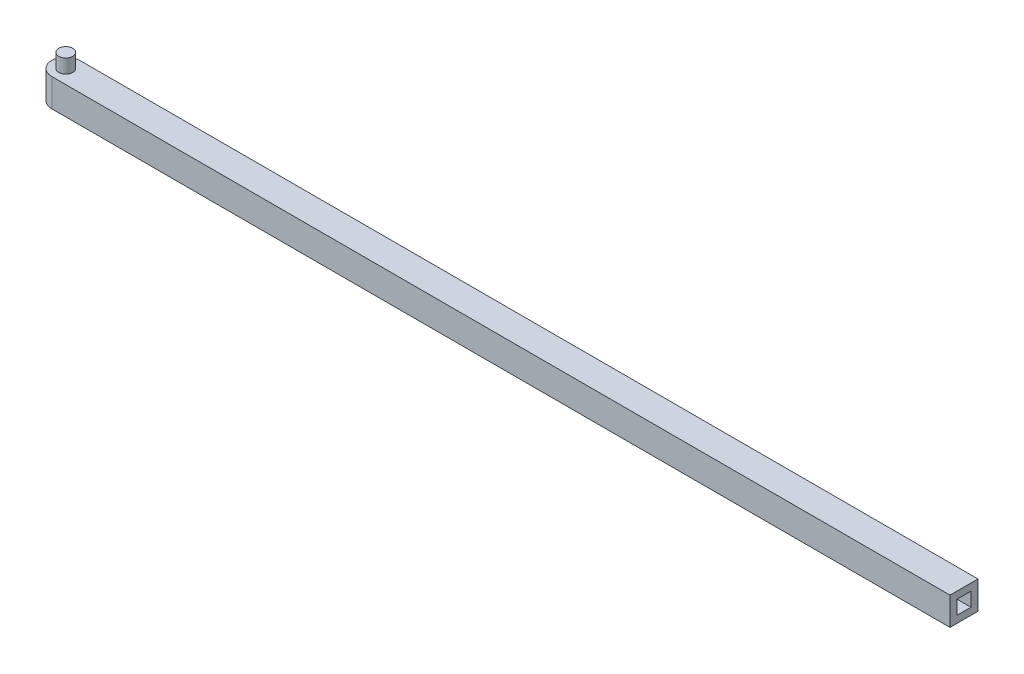
ISO-10303-21;
HEADER;
FILE_DESCRIPTION(('STEP AP214'),'2;1');
FILE_NAME('part.step','',(''),(''),'','','');
FILE_SCHEMA(('AUTOMOTIVE_DESIGN { 1 0 10303 214 1 1 1 1 }'));
ENDSEC;
DATA;
#1=APPLICATION_CONTEXT('core data for automotive mechanical design processes');
#2=APPLICATION_PROTOCOL_DEFINITION('international standard','automotive_design',2000,#1);
#3=PRODUCT_CONTEXT('',#1,'mechanical');
#4=PRODUCT('Part','Part','',(#3));
#5=PRODUCT_RELATED_PRODUCT_CATEGORY('part','',(#4));
#6=PRODUCT_DEFINITION_FORMATION('','',#4);
#7=PRODUCT_DEFINITION_CONTEXT('part definition',#1,'design');
#8=PRODUCT_DEFINITION('design','',#6,#7);
#9=PRODUCT_DEFINITION_SHAPE('','',#8);
#10=(LENGTH_UNIT() NAMED_UNIT(*) SI_UNIT(.MILLI.,.METRE.));
#11=(NAMED_UNIT(*) PLANE_ANGLE_UNIT() SI_UNIT($,.RADIAN.));
#12=(NAMED_UNIT(*) SI_UNIT($,.STERADIAN.) SOLID_ANGLE_UNIT());
#13=UNCERTAINTY_MEASURE_WITH_UNIT(LENGTH_MEASURE(1.E-05),#10,'distance_accuracy_value','');
#14=(GEOMETRIC_REPRESENTATION_CONTEXT(3) GLOBAL_UNCERTAINTY_ASSIGNED_CONTEXT((#13)) GLOBAL_UNIT_ASSIGNED_CONTEXT((#10,
#11,#12)) REPRESENTATION_CONTEXT('',''));
#15=CARTESIAN_POINT('',(0.,0.,0.));
#16=DIRECTION('',(0.,0.,1.));
#17=DIRECTION('',(1.,0.,0.));
#18=AXIS2_PLACEMENT_3D('',#15,#16,#17);
#19=CARTESIAN_POINT('',(0.,-20.,0.));
#20=DIRECTION('',(0.,1.,0.));
#21=DIRECTION('',(0.,0.,1.));
#22=AXIS2_PLACEMENT_3D('',#19,#20,#21);
#23=CYLINDRICAL_SURFACE('',#22,5.);
#24=CARTESIAN_POINT('',(0.,0.,0.));
#25=DIRECTION('',(0.,-1.,0.));
#26=DIRECTION('',(0.,0.,-1.));
#27=AXIS2_PLACEMENT_3D('',#24,#25,#26);
#28=CIRCLE('',#27,5.);
#29=CARTESIAN_POINT('',(0.,0.,-5.));
#30=VERTEX_POINT('',#29);
#31=EDGE_CURVE('E159',#30,#30,#28,.T.);
#32=ORIENTED_EDGE('',*,*,#31,.F.);
#33=EDGE_LOOP('',(#32));
#34=FACE_BOUND('',#33,.T.);
#35=CARTESIAN_POINT('',(0.,-10.,0.));
#36=DIRECTION('',(0.,-1.,0.));
#37=DIRECTION('',(0.,0.,-1.));
#38=AXIS2_PLACEMENT_3D('',#35,#36,#37);
#39=CIRCLE('',#38,5.);
#40=CARTESIAN_POINT('',(0.,-10.,-5.));
#41=VERTEX_POINT('',#40);
#42=EDGE_CURVE('E141',#41,#41,#39,.T.);
#43=ORIENTED_EDGE('',*,*,#42,.T.);
#44=EDGE_LOOP('',(#43));
#45=FACE_BOUND('',#44,.T.);
#46=ADVANCED_FACE('F44',(#34,#45),#23,.F.);
#47=CARTESIAN_POINT('',(0.,-20.,-10.0000000000001));
#48=DIRECTION('',(0.,0.,-1.));
#49=DIRECTION('',(-1.,0.,0.));
#50=AXIS2_PLACEMENT_3D('',#47,#48,#49);
#51=PLANE('',#50);
#52=DIRECTION('',(-1.,0.,0.));
#53=VECTOR('',#52,1.);
#54=CARTESIAN_POINT('',(0.,0.,-10.0000000000001));
#55=LINE('',#54,#53);
#56=CARTESIAN_POINT('',(641.987277325311,0.,-10.));
#57=VERTEX_POINT('',#56);
#58=CARTESIAN_POINT('',(-0.0127226746890739,0.,-10.0000000000001));
#59=VERTEX_POINT('',#58);
#60=EDGE_CURVE('E152',#57,#59,#55,.T.);
#61=ORIENTED_EDGE('',*,*,#60,.F.);
#62=DIRECTION('',(0.,1.,0.));
#63=VECTOR('',#62,1.);
#64=CARTESIAN_POINT('',(641.987277325311,-20.,-10.));
#65=LINE('',#64,#63);
#66=CARTESIAN_POINT('',(641.987277325311,-20.,-10.));
#67=VERTEX_POINT('',#66);
#68=EDGE_CURVE('E12',#67,#57,#65,.T.);
#69=ORIENTED_EDGE('',*,*,#68,.F.);
#70=DIRECTION('',(-1.,0.,0.));
#71=VECTOR('',#70,1.);
#72=CARTESIAN_POINT('',(0.,-20.,-10.0000000000001));
#73=LINE('',#72,#71);
#74=CARTESIAN_POINT('',(-0.0127226746890739,-20.,-10.0000000000001));
#75=VERTEX_POINT('',#74);
#76=EDGE_CURVE('E156',#67,#75,#73,.T.);
#77=ORIENTED_EDGE('',*,*,#76,.T.);
#78=DIRECTION('',(0.,1.,0.));
#79=VECTOR('',#78,1.);
#80=CARTESIAN_POINT('',(-0.0127226746890739,-20.,-10.0000000000001));
#81=LINE('',#80,#79);
#82=EDGE_CURVE('E89',#75,#59,#81,.T.);
#83=ORIENTED_EDGE('',*,*,#82,.T.);
#84=EDGE_LOOP('',(#61,#69,#77,#83));
#85=FACE_BOUND('',#84,.T.);
#86=ADVANCED_FACE('F46',(#85),#51,.T.);
#87=CARTESIAN_POINT('',(641.987277325311,-20.,0.));
#88=DIRECTION('',(1.,0.,0.));
#89=DIRECTION('',(0.,0.,-1.));
#90=AXIS2_PLACEMENT_3D('',#87,#88,#89);
#91=PLANE('',#90);
#92=DIRECTION('',(0.,1.,0.));
#93=VECTOR('',#92,1.);
#94=CARTESIAN_POINT('',(641.987277325311,-15.,-5.));
#95=LINE('',#94,#93);
#96=CARTESIAN_POINT('',(641.987277325311,-15.,-5.));
#97=VERTEX_POINT('',#96);
#98=CARTESIAN_POINT('',(641.987277325311,-5.,-5.));
#99=VERTEX_POINT('',#98);
#100=EDGE_CURVE('E59',#97,#99,#95,.T.);
#101=ORIENTED_EDGE('',*,*,#100,.F.);
#102=DIRECTION('',(0.,0.,-1.));
#103=VECTOR('',#102,1.);
#104=CARTESIAN_POINT('',(641.987277325311,-15.,5.));
#105=LINE('',#104,#103);
#106=CARTESIAN_POINT('',(641.987277325311,-15.,5.));
#107=VERTEX_POINT('',#106);
#108=EDGE_CURVE('E135',#107,#97,#105,.T.);
#109=ORIENTED_EDGE('',*,*,#108,.F.);
#110=DIRECTION('',(0.,-1.,0.));
#111=VECTOR('',#110,1.);
#112=CARTESIAN_POINT('',(641.987277325311,-5.,5.));
#113=LINE('',#112,#111);
#114=CARTESIAN_POINT('',(641.987277325311,-5.,5.));
#115=VERTEX_POINT('',#114);
#116=EDGE_CURVE('E138',#115,#107,#113,.T.);
#117=ORIENTED_EDGE('',*,*,#116,.F.);
#118=DIRECTION('',(0.,0.,1.));
#119=VECTOR('',#118,1.);
#120=CARTESIAN_POINT('',(641.987277325311,-5.,-5.));
#121=LINE('',#120,#119);
#122=EDGE_CURVE('E146',#99,#115,#121,.T.);
#123=ORIENTED_EDGE('',*,*,#122,.F.);
#124=EDGE_LOOP('',(#101,#109,#117,#123));
#125=FACE_BOUND('',#124,.T.);
#126=DIRECTION('',(0.,0.,-1.));
#127=VECTOR('',#126,1.);
#128=CARTESIAN_POINT('',(641.987277325311,0.,0.));
#129=LINE('',#128,#127);
#130=CARTESIAN_POINT('',(641.987277325311,0.,10.));
#131=VERTEX_POINT('',#130);
#132=EDGE_CURVE('E168',#131,#57,#129,.T.);
#133=ORIENTED_EDGE('',*,*,#132,.F.);
#134=DIRECTION('',(0.,1.,0.));
#135=VECTOR('',#134,1.);
#136=CARTESIAN_POINT('',(641.987277325311,-20.,10.));
#137=LINE('',#136,#135);
#138=CARTESIAN_POINT('',(641.987277325311,-20.,10.));
#139=VERTEX_POINT('',#138);
#140=EDGE_CURVE('E52',#139,#131,#137,.T.);
#141=ORIENTED_EDGE('',*,*,#140,.F.);
#142=DIRECTION('',(0.,0.,-1.));
#143=VECTOR('',#142,1.);
#144=CARTESIAN_POINT('',(641.987277325311,-20.,0.));
#145=LINE('',#144,#143);
#146=EDGE_CURVE('E158',#139,#67,#145,.T.);
#147=ORIENTED_EDGE('',*,*,#146,.T.);
#148=ORIENTED_EDGE('',*,*,#68,.T.);
#149=EDGE_LOOP('',(#133,#141,#147,#148));
#150=FACE_BOUND('',#149,.T.);
#151=ADVANCED_FACE('F186',(#125,#150),#91,.T.);
#152=CARTESIAN_POINT('',(0.,-20.,10.0000000000001));
#153=DIRECTION('',(0.,0.,1.));
#154=DIRECTION('',(1.,0.,0.));
#155=AXIS2_PLACEMENT_3D('',#152,#153,#154);
#156=PLANE('',#155);
#157=DIRECTION('',(1.,0.,0.));
#158=VECTOR('',#157,1.);
#159=CARTESIAN_POINT('',(0.,0.,10.0000000000001));
#160=LINE('',#159,#158);
#161=CARTESIAN_POINT('',(-0.00426304448138461,0.,10.0000000000001));
#162=VERTEX_POINT('',#161);
#163=EDGE_CURVE('E171',#162,#131,#160,.T.);
#164=ORIENTED_EDGE('',*,*,#163,.F.);
#165=DIRECTION('',(0.,1.,0.));
#166=VECTOR('',#165,1.);
#167=CARTESIAN_POINT('',(-0.00426304448138461,-20.,10.0000000000001));
#168=LINE('',#167,#166);
#169=CARTESIAN_POINT('',(-0.00426304448138461,-20.,10.0000000000001));
#170=VERTEX_POINT('',#169);
#171=EDGE_CURVE('E179',#170,#162,#168,.T.);
#172=ORIENTED_EDGE('',*,*,#171,.F.);
#173=DIRECTION('',(1.,0.,0.));
#174=VECTOR('',#173,1.);
#175=CARTESIAN_POINT('',(0.,-20.,10.0000000000001));
#176=LINE('',#175,#174);
#177=EDGE_CURVE('E162',#170,#139,#176,.T.);
#178=ORIENTED_EDGE('',*,*,#177,.T.);
#179=ORIENTED_EDGE('',*,*,#140,.T.);
#180=EDGE_LOOP('',(#164,#172,#178,#179));
#181=FACE_BOUND('',#180,.T.);
#182=ADVANCED_FACE('F183',(#181),#156,.T.);
#183=CARTESIAN_POINT('',(0.,-20.,0.));
#184=DIRECTION('',(0.,1.,0.));
#185=DIRECTION('',(0.,0.,1.));
#186=AXIS2_PLACEMENT_3D('',#183,#184,#185);
#187=CYLINDRICAL_SURFACE('',#186,10.0000009086775);
#188=CARTESIAN_POINT('',(0.,0.,0.));
#189=DIRECTION('',(0.,-1.,0.));
#190=DIRECTION('',(0.,0.,-1.));
#191=AXIS2_PLACEMENT_3D('',#188,#189,#190);
#192=CIRCLE('',#191,10.0000009086775);
#193=EDGE_CURVE('E174',#162,#59,#192,.T.);
#194=ORIENTED_EDGE('',*,*,#193,.T.);
#195=ORIENTED_EDGE('',*,*,#82,.F.);
#196=CARTESIAN_POINT('',(0.,-20.,0.));
#197=DIRECTION('',(0.,-1.,0.));
#198=DIRECTION('',(0.,0.,-1.));
#199=AXIS2_PLACEMENT_3D('',#196,#197,#198);
#200=CIRCLE('',#199,10.0000009086775);
#201=EDGE_CURVE('E68',#170,#75,#200,.T.);
#202=ORIENTED_EDGE('',*,*,#201,.F.);
#203=ORIENTED_EDGE('',*,*,#171,.T.);
#204=EDGE_LOOP('',(#194,#195,#202,#203));
#205=FACE_BOUND('',#204,.T.);
#206=ADVANCED_FACE('F192',(#205),#187,.T.);
#207=CARTESIAN_POINT('',(0.,-20.,0.));
#208=DIRECTION('',(0.,-1.,0.));
#209=DIRECTION('',(0.,0.,-1.));
#210=AXIS2_PLACEMENT_3D('',#207,#208,#209);
#211=PLANE('',#210);
#212=ORIENTED_EDGE('',*,*,#76,.F.);
#213=ORIENTED_EDGE('',*,*,#146,.F.);
#214=ORIENTED_EDGE('',*,*,#177,.F.);
#215=ORIENTED_EDGE('',*,*,#201,.T.);
#216=EDGE_LOOP('',(#212,#213,#214,#215));
#217=FACE_BOUND('',#216,.T.);
#218=ADVANCED_FACE('F193',(#217),#211,.T.);
#219=CARTESIAN_POINT('',(0.,0.,0.));
#220=DIRECTION('',(0.,-1.,0.));
#221=DIRECTION('',(0.,0.,-1.));
#222=AXIS2_PLACEMENT_3D('',#219,#220,#221);
#223=PLANE('',#222);
#224=ORIENTED_EDGE('',*,*,#60,.T.);
#225=ORIENTED_EDGE('',*,*,#193,.F.);
#226=ORIENTED_EDGE('',*,*,#163,.T.);
#227=ORIENTED_EDGE('',*,*,#132,.T.);
#228=EDGE_LOOP('',(#224,#225,#226,#227));
#229=FACE_BOUND('',#228,.T.);
#230=ORIENTED_EDGE('',*,*,#31,.T.);
#231=EDGE_LOOP('',(#230));
#232=FACE_BOUND('',#231,.T.);
#233=ADVANCED_FACE('F189',(#229,#232),#223,.F.);
#234=CARTESIAN_POINT('',(631.987277325311,-15.,-5.));
#235=DIRECTION('',(0.,0.,-1.));
#236=DIRECTION('',(0.,1.,0.));
#237=AXIS2_PLACEMENT_3D('',#234,#235,#236);
#238=PLANE('',#237);
#239=ORIENTED_EDGE('',*,*,#100,.T.);
#240=DIRECTION('',(1.,0.,0.));
#241=VECTOR('',#240,1.);
#242=CARTESIAN_POINT('',(631.987277325311,-5.,-5.));
#243=LINE('',#242,#241);
#244=CARTESIAN_POINT('',(631.987277325311,-5.,-5.));
#245=VERTEX_POINT('',#244);
#246=EDGE_CURVE('E113',#245,#99,#243,.T.);
#247=ORIENTED_EDGE('',*,*,#246,.F.);
#248=DIRECTION('',(0.,1.,0.));
#249=VECTOR('',#248,1.);
#250=CARTESIAN_POINT('',(631.987277325311,-15.,-5.));
#251=LINE('',#250,#249);
#252=CARTESIAN_POINT('',(631.987277325311,-15.,-5.));
#253=VERTEX_POINT('',#252);
#254=EDGE_CURVE('E117',#253,#245,#251,.T.);
#255=ORIENTED_EDGE('',*,*,#254,.F.);
#256=DIRECTION('',(1.,0.,0.));
#257=VECTOR('',#256,1.);
#258=CARTESIAN_POINT('',(631.987277325311,-15.,-5.));
#259=LINE('',#258,#257);
#260=EDGE_CURVE('E150',#253,#97,#259,.T.);
#261=ORIENTED_EDGE('',*,*,#260,.T.);
#262=EDGE_LOOP('',(#239,#247,#255,#261));
#263=FACE_BOUND('',#262,.T.);
#264=ADVANCED_FACE('F115',(#263),#238,.F.);
#265=CARTESIAN_POINT('',(631.987277325311,-15.,5.));
#266=DIRECTION('',(0.,-1.,0.));
#267=DIRECTION('',(0.,0.,-1.));
#268=AXIS2_PLACEMENT_3D('',#265,#266,#267);
#269=PLANE('',#268);
#270=ORIENTED_EDGE('',*,*,#108,.T.);
#271=ORIENTED_EDGE('',*,*,#260,.F.);
#272=DIRECTION('',(0.,0.,-1.));
#273=VECTOR('',#272,1.);
#274=CARTESIAN_POINT('',(631.987277325311,-15.,5.));
#275=LINE('',#274,#273);
#276=CARTESIAN_POINT('',(631.987277325311,-15.,5.));
#277=VERTEX_POINT('',#276);
#278=EDGE_CURVE('E123',#277,#253,#275,.T.);
#279=ORIENTED_EDGE('',*,*,#278,.F.);
#280=DIRECTION('',(1.,0.,0.));
#281=VECTOR('',#280,1.);
#282=CARTESIAN_POINT('',(631.987277325311,-15.,5.));
#283=LINE('',#282,#281);
#284=EDGE_CURVE('E153',#277,#107,#283,.T.);
#285=ORIENTED_EDGE('',*,*,#284,.T.);
#286=EDGE_LOOP('',(#270,#271,#279,#285));
#287=FACE_BOUND('',#286,.T.);
#288=ADVANCED_FACE('F237',(#287),#269,.F.);
#289=CARTESIAN_POINT('',(631.987277325311,-5.,5.));
#290=DIRECTION('',(0.,0.,1.));
#291=DIRECTION('',(0.,-1.,0.));
#292=AXIS2_PLACEMENT_3D('',#289,#290,#291);
#293=PLANE('',#292);
#294=ORIENTED_EDGE('',*,*,#116,.T.);
#295=ORIENTED_EDGE('',*,*,#284,.F.);
#296=DIRECTION('',(0.,-1.,0.));
#297=VECTOR('',#296,1.);
#298=CARTESIAN_POINT('',(631.987277325311,-5.,5.));
#299=LINE('',#298,#297);
#300=CARTESIAN_POINT('',(631.987277325311,-5.,5.));
#301=VERTEX_POINT('',#300);
#302=EDGE_CURVE('E131',#301,#277,#299,.T.);
#303=ORIENTED_EDGE('',*,*,#302,.F.);
#304=DIRECTION('',(1.,0.,0.));
#305=VECTOR('',#304,1.);
#306=CARTESIAN_POINT('',(631.987277325311,-5.,5.));
#307=LINE('',#306,#305);
#308=EDGE_CURVE('E122',#301,#115,#307,.T.);
#309=ORIENTED_EDGE('',*,*,#308,.T.);
#310=EDGE_LOOP('',(#294,#295,#303,#309));
#311=FACE_BOUND('',#310,.T.);
#312=ADVANCED_FACE('F244',(#311),#293,.F.);
#313=CARTESIAN_POINT('',(631.987277325311,-5.,-5.));
#314=DIRECTION('',(0.,1.,0.));
#315=DIRECTION('',(0.,0.,1.));
#316=AXIS2_PLACEMENT_3D('',#313,#314,#315);
#317=PLANE('',#316);
#318=ORIENTED_EDGE('',*,*,#122,.T.);
#319=ORIENTED_EDGE('',*,*,#308,.F.);
#320=DIRECTION('',(0.,0.,1.));
#321=VECTOR('',#320,1.);
#322=CARTESIAN_POINT('',(631.987277325311,-5.,-5.));
#323=LINE('',#322,#321);
#324=EDGE_CURVE('E126',#245,#301,#323,.T.);
#325=ORIENTED_EDGE('',*,*,#324,.F.);
#326=ORIENTED_EDGE('',*,*,#246,.T.);
#327=EDGE_LOOP('',(#318,#319,#325,#326));
#328=FACE_BOUND('',#327,.T.);
#329=ADVANCED_FACE('F127',(#328),#317,.F.);
#330=CARTESIAN_POINT('',(631.987277325311,0.,0.));
#331=DIRECTION('',(1.,0.,0.));
#332=DIRECTION('',(0.,0.,-1.));
#333=AXIS2_PLACEMENT_3D('',#330,#331,#332);
#334=PLANE('',#333);
#335=ORIENTED_EDGE('',*,*,#254,.T.);
#336=ORIENTED_EDGE('',*,*,#324,.T.);
#337=ORIENTED_EDGE('',*,*,#302,.T.);
#338=ORIENTED_EDGE('',*,*,#278,.T.);
#339=EDGE_LOOP('',(#335,#336,#337,#338));
#340=FACE_BOUND('',#339,.T.);
#341=ADVANCED_FACE('F133',(#340),#334,.T.);
#342=CARTESIAN_POINT('',(0.,-10.,0.));
#343=DIRECTION('',(0.,-1.,0.));
#344=DIRECTION('',(0.,0.,-1.));
#345=AXIS2_PLACEMENT_3D('',#342,#343,#344);
#346=PLANE('',#345);
#347=ORIENTED_EDGE('',*,*,#42,.F.);
#348=EDGE_LOOP('',(#347));
#349=FACE_BOUND('',#348,.T.);
#350=ADVANCED_FACE('F265',(#349),#346,.F.);
#351=CLOSED_SHELL('',(#46,#86,#151,#182,#206,#218,#233,#264,#288,#312,#329,#341,#350));
#352=MANIFOLD_SOLID_BREP('B2',#351);
#353=CARTESIAN_POINT('',(0.,10.,0.));
#354=DIRECTION('',(0.,-1.,0.));
#355=DIRECTION('',(0.,0.,-1.));
#356=AXIS2_PLACEMENT_3D('',#353,#354,#355);
#357=CYLINDRICAL_SURFACE('',#356,5.);
#358=CARTESIAN_POINT('',(0.,10.,0.));
#359=DIRECTION('',(0.,1.,0.));
#360=DIRECTION('',(0.,0.,1.));
#361=AXIS2_PLACEMENT_3D('',#358,#359,#360);
#362=CIRCLE('',#361,5.);
#363=CARTESIAN_POINT('',(0.,10.,5.));
#364=VERTEX_POINT('',#363);
#365=EDGE_CURVE('E43',#364,#364,#362,.T.);
#366=ORIENTED_EDGE('',*,*,#365,.F.);
#367=EDGE_LOOP('',(#366));
#368=FACE_BOUND('',#367,.T.);
#369=CARTESIAN_POINT('',(0.,0.,0.));
#370=DIRECTION('',(0.,1.,0.));
#371=DIRECTION('',(0.,0.,1.));
#372=AXIS2_PLACEMENT_3D('',#369,#370,#371);
#373=CIRCLE('',#372,5.);
#374=CARTESIAN_POINT('',(0.,0.,5.));
#375=VERTEX_POINT('',#374);
#376=EDGE_CURVE('E336',#375,#375,#373,.T.);
#377=ORIENTED_EDGE('',*,*,#376,.T.);
#378=EDGE_LOOP('',(#377));
#379=FACE_BOUND('',#378,.T.);
#380=ADVANCED_FACE('F333',(#368,#379),#357,.T.);
#381=CARTESIAN_POINT('',(0.,10.,0.));
#382=DIRECTION('',(0.,1.,0.));
#383=DIRECTION('',(0.,0.,1.));
#384=AXIS2_PLACEMENT_3D('',#381,#382,#383);
#385=PLANE('',#384);
#386=ORIENTED_EDGE('',*,*,#365,.T.);
#387=EDGE_LOOP('',(#386));
#388=FACE_BOUND('',#387,.T.);
#389=ADVANCED_FACE('F348',(#388),#385,.T.);
#390=CARTESIAN_POINT('',(0.,0.,0.));
#391=DIRECTION('',(0.,1.,0.));
#392=DIRECTION('',(0.,0.,1.));
#393=AXIS2_PLACEMENT_3D('',#390,#391,#392);
#394=PLANE('',#393);
#395=ORIENTED_EDGE('',*,*,#376,.F.);
#396=EDGE_LOOP('',(#395));
#397=FACE_BOUND('',#396,.T.);
#398=ADVANCED_FACE('F346',(#397),#394,.F.);
#399=CLOSED_SHELL('',(#380,#389,#398));
#400=MANIFOLD_SOLID_BREP('B6',#399);
#401=ADVANCED_BREP_SHAPE_REPRESENTATION('',(#18,#352,#400),#14);
#402=SHAPE_DEFINITION_REPRESENTATION(#9,#401);
ENDSEC;
END-ISO-10303-21;
